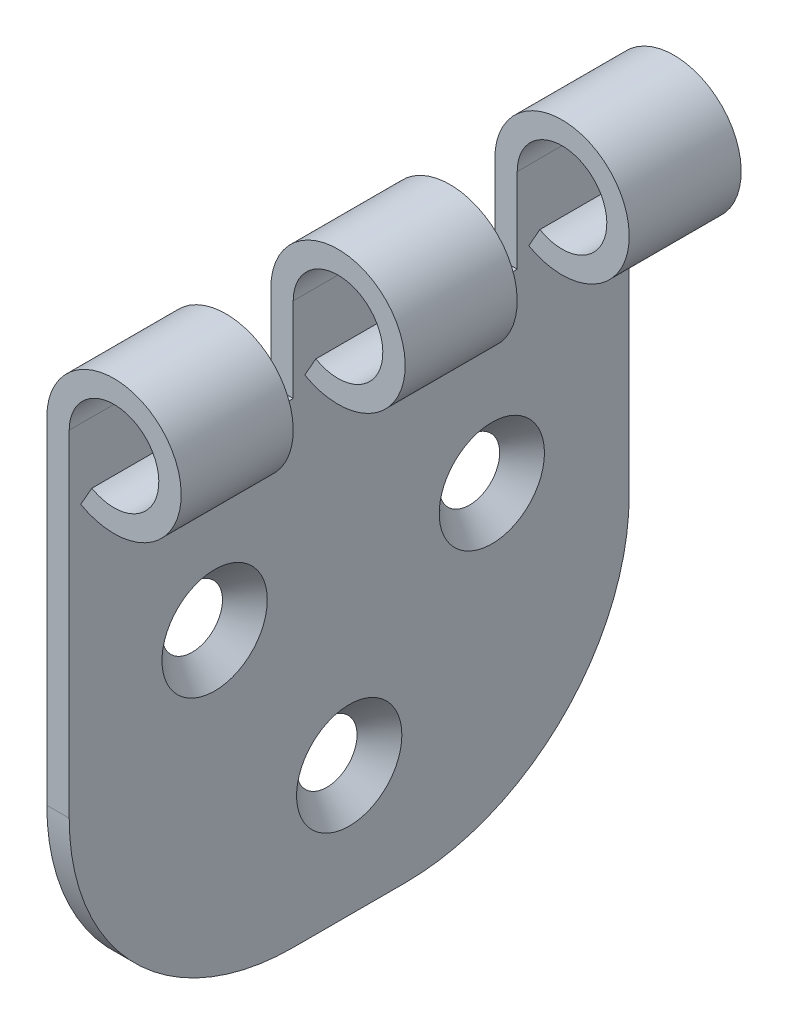
ISO-10303-21;
HEADER;
FILE_DESCRIPTION(('STEP AP214'),'2;1');
FILE_NAME('part.step','',(''),(''),'','','');
FILE_SCHEMA(('AUTOMOTIVE_DESIGN { 1 0 10303 214 1 1 1 1 }'));
ENDSEC;
DATA;
#1=APPLICATION_CONTEXT('core data for automotive mechanical design processes');
#2=APPLICATION_PROTOCOL_DEFINITION('international standard','automotive_design',2000,#1);
#3=PRODUCT_CONTEXT('',#1,'mechanical');
#4=PRODUCT('Part','Part','',(#3));
#5=PRODUCT_RELATED_PRODUCT_CATEGORY('part','',(#4));
#6=PRODUCT_DEFINITION_FORMATION('','',#4);
#7=PRODUCT_DEFINITION_CONTEXT('part definition',#1,'design');
#8=PRODUCT_DEFINITION('design','',#6,#7);
#9=PRODUCT_DEFINITION_SHAPE('','',#8);
#10=(LENGTH_UNIT() NAMED_UNIT(*) SI_UNIT(.MILLI.,.METRE.));
#11=(NAMED_UNIT(*) PLANE_ANGLE_UNIT() SI_UNIT($,.RADIAN.));
#12=(NAMED_UNIT(*) SI_UNIT($,.STERADIAN.) SOLID_ANGLE_UNIT());
#13=UNCERTAINTY_MEASURE_WITH_UNIT(LENGTH_MEASURE(1.E-05),#10,'distance_accuracy_value','');
#14=(GEOMETRIC_REPRESENTATION_CONTEXT(3) GLOBAL_UNCERTAINTY_ASSIGNED_CONTEXT((#13)) GLOBAL_UNIT_ASSIGNED_CONTEXT((#10,
#11,#12)) REPRESENTATION_CONTEXT('',''));
#15=CARTESIAN_POINT('',(0.,0.,0.));
#16=DIRECTION('',(0.,0.,1.));
#17=DIRECTION('',(1.,0.,0.));
#18=AXIS2_PLACEMENT_3D('',#15,#16,#17);
#19=CARTESIAN_POINT('',(1.99999999999999,50.,25.));
#20=DIRECTION('',(-1.,0.,0.));
#21=DIRECTION('',(0.,-1.,0.));
#22=AXIS2_PLACEMENT_3D('',#19,#20,#21);
#23=PLANE('',#22);
#24=CARTESIAN_POINT('',(2.,28.0397626935268,12.0173285585912));
#25=DIRECTION('',(1.,0.,0.));
#26=DIRECTION('',(0.,0.,-1.));
#27=AXIS2_PLACEMENT_3D('',#24,#25,#26);
#28=CIRCLE('',#27,4.7);
#29=CARTESIAN_POINT('',(2.,28.0397626935268,7.3173285585912));
#30=VERTEX_POINT('',#29);
#31=EDGE_CURVE('E238',#30,#30,#28,.T.);
#32=ORIENTED_EDGE('',*,*,#31,.F.);
#33=EDGE_LOOP('',(#32));
#34=FACE_BOUND('',#33,.T.);
#35=CARTESIAN_POINT('',(2.,27.0383186469775,-12.7326457346978));
#36=DIRECTION('',(1.,0.,0.));
#37=DIRECTION('',(0.,0.,-1.));
#38=AXIS2_PLACEMENT_3D('',#35,#36,#37);
#39=CIRCLE('',#38,4.7);
#40=CARTESIAN_POINT('',(2.,27.0383186469775,-17.4326457346978));
#41=VERTEX_POINT('',#40);
#42=EDGE_CURVE('E227',#41,#41,#39,.T.);
#43=ORIENTED_EDGE('',*,*,#42,.F.);
#44=EDGE_LOOP('',(#43));
#45=FACE_BOUND('',#44,.T.);
#46=DIRECTION('',(0.,0.,-1.));
#47=VECTOR('',#46,1.);
#48=CARTESIAN_POINT('',(2.,0.,25.));
#49=LINE('',#48,#47);
#50=CARTESIAN_POINT('',(2.,0.,5.));
#51=VERTEX_POINT('',#50);
#52=CARTESIAN_POINT('',(2.,0.,-5.));
#53=VERTEX_POINT('',#52);
#54=EDGE_CURVE('E212',#51,#53,#49,.T.);
#55=ORIENTED_EDGE('',*,*,#54,.T.);
#56=CARTESIAN_POINT('',(2.,20.,-5.));
#57=DIRECTION('',(-1.,0.,0.));
#58=DIRECTION('',(0.,-1.,0.));
#59=AXIS2_PLACEMENT_3D('',#56,#57,#58);
#60=CIRCLE('',#59,20.);
#61=CARTESIAN_POINT('',(2.,20.,-25.));
#62=VERTEX_POINT('',#61);
#63=EDGE_CURVE('E220',#53,#62,#60,.F.);
#64=ORIENTED_EDGE('',*,*,#63,.T.);
#65=DIRECTION('',(0.,1.,0.));
#66=VECTOR('',#65,1.);
#67=CARTESIAN_POINT('',(1.99999999999999,50.,-25.));
#68=LINE('',#67,#66);
#69=CARTESIAN_POINT('',(1.99999999999999,50.,-25.));
#70=VERTEX_POINT('',#69);
#71=EDGE_CURVE('E283',#62,#70,#68,.T.);
#72=ORIENTED_EDGE('',*,*,#71,.T.);
#73=DIRECTION('',(0.,0.,-1.));
#74=VECTOR('',#73,1.);
#75=CARTESIAN_POINT('',(1.99999999999999,50.,25.));
#76=LINE('',#75,#74);
#77=CARTESIAN_POINT('',(1.99999999999999,50.,-15.));
#78=VERTEX_POINT('',#77);
#79=EDGE_CURVE('E321',#78,#70,#76,.T.);
#80=ORIENTED_EDGE('',*,*,#79,.F.);
#81=DIRECTION('',(0.,1.,0.));
#82=VECTOR('',#81,1.);
#83=CARTESIAN_POINT('',(1.99999999999999,50.,-15.));
#84=LINE('',#83,#82);
#85=CARTESIAN_POINT('',(1.99999999999999,42.4546694492504,-15.));
#86=VERTEX_POINT('',#85);
#87=EDGE_CURVE('E254',#86,#78,#84,.T.);
#88=ORIENTED_EDGE('',*,*,#87,.F.);
#89=DIRECTION('',(0.,0.,-1.));
#90=VECTOR('',#89,1.);
#91=CARTESIAN_POINT('',(1.99999999999999,42.4546694492504,25.));
#92=LINE('',#91,#90);
#93=CARTESIAN_POINT('',(1.99999999999999,42.4546694492504,-5.));
#94=VERTEX_POINT('',#93);
#95=EDGE_CURVE('E256',#94,#86,#92,.T.);
#96=ORIENTED_EDGE('',*,*,#95,.F.);
#97=DIRECTION('',(0.,-1.,0.));
#98=VECTOR('',#97,1.);
#99=CARTESIAN_POINT('',(1.99999999999999,50.,-5.));
#100=LINE('',#99,#98);
#101=CARTESIAN_POINT('',(1.99999999999999,50.,-5.));
#102=VERTEX_POINT('',#101);
#103=EDGE_CURVE('E264',#102,#94,#100,.T.);
#104=ORIENTED_EDGE('',*,*,#103,.F.);
#105=CARTESIAN_POINT('',(1.99999999999999,50.,5.));
#106=VERTEX_POINT('',#105);
#107=EDGE_CURVE('E325',#106,#102,#76,.T.);
#108=ORIENTED_EDGE('',*,*,#107,.F.);
#109=DIRECTION('',(0.,1.,0.));
#110=VECTOR('',#109,1.);
#111=CARTESIAN_POINT('',(1.99999999999999,50.,5.));
#112=LINE('',#111,#110);
#113=CARTESIAN_POINT('',(1.99999999999999,42.4546694492504,5.));
#114=VERTEX_POINT('',#113);
#115=EDGE_CURVE('E272',#114,#106,#112,.T.);
#116=ORIENTED_EDGE('',*,*,#115,.F.);
#117=DIRECTION('',(0.,0.,-1.));
#118=VECTOR('',#117,1.);
#119=CARTESIAN_POINT('',(1.99999999999999,42.4546694492504,25.));
#120=LINE('',#119,#118);
#121=CARTESIAN_POINT('',(1.99999999999999,42.4546694492504,15.));
#122=VERTEX_POINT('',#121);
#123=EDGE_CURVE('E274',#122,#114,#120,.T.);
#124=ORIENTED_EDGE('',*,*,#123,.F.);
#125=DIRECTION('',(0.,-1.,0.));
#126=VECTOR('',#125,1.);
#127=CARTESIAN_POINT('',(1.99999999999999,50.,15.));
#128=LINE('',#127,#126);
#129=CARTESIAN_POINT('',(1.99999999999999,50.,15.));
#130=VERTEX_POINT('',#129);
#131=EDGE_CURVE('E188',#130,#122,#128,.T.);
#132=ORIENTED_EDGE('',*,*,#131,.F.);
#133=CARTESIAN_POINT('',(1.99999999999999,50.,25.));
#134=VERTEX_POINT('',#133);
#135=EDGE_CURVE('E323',#134,#130,#76,.T.);
#136=ORIENTED_EDGE('',*,*,#135,.F.);
#137=DIRECTION('',(0.,1.,0.));
#138=VECTOR('',#137,1.);
#139=CARTESIAN_POINT('',(1.99999999999999,50.,25.));
#140=LINE('',#139,#138);
#141=CARTESIAN_POINT('',(2.,20.,25.));
#142=VERTEX_POINT('',#141);
#143=EDGE_CURVE('E284',#142,#134,#140,.T.);
#144=ORIENTED_EDGE('',*,*,#143,.F.);
#145=CARTESIAN_POINT('',(2.,20.,5.));
#146=DIRECTION('',(-1.,0.,0.));
#147=DIRECTION('',(0.,-1.,0.));
#148=AXIS2_PLACEMENT_3D('',#145,#146,#147);
#149=CIRCLE('',#148,20.);
#150=EDGE_CURVE('E218',#142,#51,#149,.F.);
#151=ORIENTED_EDGE('',*,*,#150,.T.);
#152=EDGE_LOOP('',(#55,#64,#72,#80,#88,#96,#104,#108,#116,#124,#132,#136,#144,#151));
#153=FACE_BOUND('',#152,.T.);
#154=CARTESIAN_POINT('',(2.,11.5874676430746,0.));
#155=DIRECTION('',(1.,0.,0.));
#156=DIRECTION('',(0.,0.,-1.));
#157=AXIS2_PLACEMENT_3D('',#154,#155,#156);
#158=CIRCLE('',#157,4.7);
#159=CARTESIAN_POINT('',(2.,11.5874676430746,-4.7));
#160=VERTEX_POINT('',#159);
#161=EDGE_CURVE('E612',#160,#160,#158,.T.);
#162=ORIENTED_EDGE('',*,*,#161,.F.);
#163=EDGE_LOOP('',(#162));
#164=FACE_BOUND('',#163,.T.);
#165=ADVANCED_FACE('F38',(#34,#45,#153,#164),#23,.F.);
#166=CARTESIAN_POINT('',(0.,0.,25.));
#167=DIRECTION('',(1.,0.,0.));
#168=DIRECTION('',(0.,0.,-1.));
#169=AXIS2_PLACEMENT_3D('',#166,#167,#168);
#170=PLANE('',#169);
#171=CARTESIAN_POINT('',(0.,11.5874676430746,0.));
#172=DIRECTION('',(1.,0.,0.));
#173=DIRECTION('',(0.,0.,-1.));
#174=AXIS2_PLACEMENT_3D('',#171,#172,#173);
#175=CIRCLE('',#174,2.7);
#176=CARTESIAN_POINT('',(0.,11.5874676430746,-2.7));
#177=VERTEX_POINT('',#176);
#178=EDGE_CURVE('E615',#177,#177,#175,.T.);
#179=ORIENTED_EDGE('',*,*,#178,.T.);
#180=EDGE_LOOP('',(#179));
#181=FACE_BOUND('',#180,.T.);
#182=CARTESIAN_POINT('',(0.,28.0397626935268,12.0173285585912));
#183=DIRECTION('',(1.,0.,0.));
#184=DIRECTION('',(0.,0.,-1.));
#185=AXIS2_PLACEMENT_3D('',#182,#183,#184);
#186=CIRCLE('',#185,2.7);
#187=CARTESIAN_POINT('',(0.,28.0397626935268,9.3173285585912));
#188=VERTEX_POINT('',#187);
#189=EDGE_CURVE('E42',#188,#188,#186,.T.);
#190=ORIENTED_EDGE('',*,*,#189,.T.);
#191=EDGE_LOOP('',(#190));
#192=FACE_BOUND('',#191,.T.);
#193=CARTESIAN_POINT('',(0.,27.0383186469775,-12.7326457346978));
#194=DIRECTION('',(1.,0.,0.));
#195=DIRECTION('',(0.,0.,-1.));
#196=AXIS2_PLACEMENT_3D('',#193,#194,#195);
#197=CIRCLE('',#196,2.7);
#198=CARTESIAN_POINT('',(0.,27.0383186469775,-15.4326457346978));
#199=VERTEX_POINT('',#198);
#200=EDGE_CURVE('E224',#199,#199,#197,.T.);
#201=ORIENTED_EDGE('',*,*,#200,.T.);
#202=EDGE_LOOP('',(#201));
#203=FACE_BOUND('',#202,.T.);
#204=DIRECTION('',(0.,-1.,0.));
#205=VECTOR('',#204,1.);
#206=CARTESIAN_POINT('',(0.,0.,-25.));
#207=LINE('',#206,#205);
#208=CARTESIAN_POINT('',(0.,50.,-25.));
#209=VERTEX_POINT('',#208);
#210=CARTESIAN_POINT('',(0.,20.,-25.));
#211=VERTEX_POINT('',#210);
#212=EDGE_CURVE('E287',#209,#211,#207,.T.);
#213=ORIENTED_EDGE('',*,*,#212,.T.);
#214=CARTESIAN_POINT('',(0.,20.,-5.));
#215=DIRECTION('',(1.,0.,0.));
#216=DIRECTION('',(0.,0.,-1.));
#217=AXIS2_PLACEMENT_3D('',#214,#215,#216);
#218=CIRCLE('',#217,20.);
#219=CARTESIAN_POINT('',(0.,0.,-5.));
#220=VERTEX_POINT('',#219);
#221=EDGE_CURVE('E47',#211,#220,#218,.F.);
#222=ORIENTED_EDGE('',*,*,#221,.T.);
#223=DIRECTION('',(0.,0.,-1.));
#224=VECTOR('',#223,1.);
#225=CARTESIAN_POINT('',(0.,0.,25.));
#226=LINE('',#225,#224);
#227=CARTESIAN_POINT('',(0.,0.,5.));
#228=VERTEX_POINT('',#227);
#229=EDGE_CURVE('E295',#228,#220,#226,.T.);
#230=ORIENTED_EDGE('',*,*,#229,.F.);
#231=CARTESIAN_POINT('',(0.,20.,5.));
#232=DIRECTION('',(1.,0.,0.));
#233=DIRECTION('',(0.,0.,-1.));
#234=AXIS2_PLACEMENT_3D('',#231,#232,#233);
#235=CIRCLE('',#234,20.);
#236=CARTESIAN_POINT('',(0.,20.,25.));
#237=VERTEX_POINT('',#236);
#238=EDGE_CURVE('E55',#228,#237,#235,.F.);
#239=ORIENTED_EDGE('',*,*,#238,.T.);
#240=DIRECTION('',(0.,-1.,0.));
#241=VECTOR('',#240,1.);
#242=CARTESIAN_POINT('',(0.,0.,25.));
#243=LINE('',#242,#241);
#244=CARTESIAN_POINT('',(0.,50.,25.));
#245=VERTEX_POINT('',#244);
#246=EDGE_CURVE('E293',#245,#237,#243,.T.);
#247=ORIENTED_EDGE('',*,*,#246,.F.);
#248=DIRECTION('',(0.,0.,-1.));
#249=VECTOR('',#248,1.);
#250=CARTESIAN_POINT('',(0.,50.,25.));
#251=LINE('',#250,#249);
#252=CARTESIAN_POINT('',(0.,50.,15.));
#253=VERTEX_POINT('',#252);
#254=EDGE_CURVE('E205',#245,#253,#251,.T.);
#255=ORIENTED_EDGE('',*,*,#254,.T.);
#256=DIRECTION('',(0.,1.,0.));
#257=VECTOR('',#256,1.);
#258=CARTESIAN_POINT('',(0.,0.,15.));
#259=LINE('',#258,#257);
#260=CARTESIAN_POINT('',(0.,42.4546694492504,15.));
#261=VERTEX_POINT('',#260);
#262=EDGE_CURVE('E185',#261,#253,#259,.T.);
#263=ORIENTED_EDGE('',*,*,#262,.F.);
#264=DIRECTION('',(0.,0.,-1.));
#265=VECTOR('',#264,1.);
#266=CARTESIAN_POINT('',(0.,42.4546694492504,15.));
#267=LINE('',#266,#265);
#268=CARTESIAN_POINT('',(0.,42.4546694492504,5.));
#269=VERTEX_POINT('',#268);
#270=EDGE_CURVE('E195',#261,#269,#267,.T.);
#271=ORIENTED_EDGE('',*,*,#270,.T.);
#272=DIRECTION('',(0.,1.,0.));
#273=VECTOR('',#272,1.);
#274=CARTESIAN_POINT('',(0.,63.0450910057158,5.));
#275=LINE('',#274,#273);
#276=CARTESIAN_POINT('',(0.,50.,5.));
#277=VERTEX_POINT('',#276);
#278=EDGE_CURVE('E200',#269,#277,#275,.T.);
#279=ORIENTED_EDGE('',*,*,#278,.T.);
#280=CARTESIAN_POINT('',(0.,50.,-5.));
#281=VERTEX_POINT('',#280);
#282=EDGE_CURVE('E312',#277,#281,#251,.T.);
#283=ORIENTED_EDGE('',*,*,#282,.T.);
#284=DIRECTION('',(0.,1.,0.));
#285=VECTOR('',#284,1.);
#286=CARTESIAN_POINT('',(0.,0.,-5.));
#287=LINE('',#286,#285);
#288=CARTESIAN_POINT('',(0.,42.4546694492504,-5.));
#289=VERTEX_POINT('',#288);
#290=EDGE_CURVE('E207',#289,#281,#287,.T.);
#291=ORIENTED_EDGE('',*,*,#290,.F.);
#292=DIRECTION('',(0.,0.,-1.));
#293=VECTOR('',#292,1.);
#294=CARTESIAN_POINT('',(0.,42.4546694492504,-5.));
#295=LINE('',#294,#293);
#296=CARTESIAN_POINT('',(0.,42.4546694492504,-15.));
#297=VERTEX_POINT('',#296);
#298=EDGE_CURVE('E226',#289,#297,#295,.T.);
#299=ORIENTED_EDGE('',*,*,#298,.T.);
#300=DIRECTION('',(0.,1.,0.));
#301=VECTOR('',#300,1.);
#302=CARTESIAN_POINT('',(0.,63.0450910057158,-15.));
#303=LINE('',#302,#301);
#304=CARTESIAN_POINT('',(0.,50.,-15.));
#305=VERTEX_POINT('',#304);
#306=EDGE_CURVE('E231',#297,#305,#303,.T.);
#307=ORIENTED_EDGE('',*,*,#306,.T.);
#308=EDGE_CURVE('E309',#305,#209,#251,.T.);
#309=ORIENTED_EDGE('',*,*,#308,.T.);
#310=EDGE_LOOP('',(#213,#222,#230,#239,#247,#255,#263,#271,#279,#283,#291,#299,#307,#309));
#311=FACE_BOUND('',#310,.T.);
#312=ADVANCED_FACE('F203',(#181,#192,#203,#311),#170,.F.);
#313=CARTESIAN_POINT('',(6.,50.,25.));
#314=DIRECTION('',(0.,0.,-1.));
#315=DIRECTION('',(-1.,0.,0.));
#316=AXIS2_PLACEMENT_3D('',#313,#314,#315);
#317=CYLINDRICAL_SURFACE('',#316,4.00000000000001);
#318=CARTESIAN_POINT('',(6.,50.,15.));
#319=DIRECTION('',(0.,0.,-1.));
#320=DIRECTION('',(-1.,0.,0.));
#321=AXIS2_PLACEMENT_3D('',#318,#319,#320);
#322=CIRCLE('',#321,4.00000000000001);
#323=CARTESIAN_POINT('',(4.02184665664863,46.5233767316277,15.));
#324=VERTEX_POINT('',#323);
#325=EDGE_CURVE('E280',#324,#130,#322,.F.);
#326=ORIENTED_EDGE('',*,*,#325,.F.);
#327=DIRECTION('',(0.,0.,-1.));
#328=VECTOR('',#327,1.);
#329=CARTESIAN_POINT('',(4.02184665664862,46.5233767316277,25.));
#330=LINE('',#329,#328);
#331=CARTESIAN_POINT('',(4.02184665664862,46.5233767316277,25.));
#332=VERTEX_POINT('',#331);
#333=EDGE_CURVE('E318',#332,#324,#330,.T.);
#334=ORIENTED_EDGE('',*,*,#333,.F.);
#335=CARTESIAN_POINT('',(6.,50.,25.));
#336=DIRECTION('',(0.,0.,-1.));
#337=DIRECTION('',(1.,0.,0.));
#338=AXIS2_PLACEMENT_3D('',#335,#336,#337);
#339=CIRCLE('',#338,4.00000000000001);
#340=EDGE_CURVE('E286',#134,#332,#339,.T.);
#341=ORIENTED_EDGE('',*,*,#340,.F.);
#342=ORIENTED_EDGE('',*,*,#135,.T.);
#343=EDGE_LOOP('',(#326,#334,#341,#342));
#344=FACE_BOUND('',#343,.T.);
#345=ADVANCED_FACE('F344',(#344),#317,.F.);
#346=CARTESIAN_POINT('',(6.,50.,5.));
#347=DIRECTION('',(0.,0.,1.));
#348=DIRECTION('',(1.,0.,0.));
#349=AXIS2_PLACEMENT_3D('',#346,#347,#348);
#350=CIRCLE('',#349,4.00000000000001);
#351=CARTESIAN_POINT('',(4.02184665664863,46.5233767316277,5.));
#352=VERTEX_POINT('',#351);
#353=EDGE_CURVE('E270',#106,#352,#350,.F.);
#354=ORIENTED_EDGE('',*,*,#353,.F.);
#355=ORIENTED_EDGE('',*,*,#107,.T.);
#356=CARTESIAN_POINT('',(6.,50.,-5.));
#357=DIRECTION('',(0.,0.,-1.));
#358=DIRECTION('',(-1.,0.,0.));
#359=AXIS2_PLACEMENT_3D('',#356,#357,#358);
#360=CIRCLE('',#359,4.00000000000001);
#361=CARTESIAN_POINT('',(4.02184665664863,46.5233767316277,-5.));
#362=VERTEX_POINT('',#361);
#363=EDGE_CURVE('E262',#362,#102,#360,.F.);
#364=ORIENTED_EDGE('',*,*,#363,.F.);
#365=EDGE_CURVE('E322',#352,#362,#330,.T.);
#366=ORIENTED_EDGE('',*,*,#365,.F.);
#367=EDGE_LOOP('',(#354,#355,#364,#366));
#368=FACE_BOUND('',#367,.T.);
#369=ADVANCED_FACE('F414',(#368),#317,.F.);
#370=CARTESIAN_POINT('',(6.,50.,-15.));
#371=DIRECTION('',(0.,0.,1.));
#372=DIRECTION('',(1.,0.,0.));
#373=AXIS2_PLACEMENT_3D('',#370,#371,#372);
#374=CIRCLE('',#373,4.00000000000001);
#375=CARTESIAN_POINT('',(4.02184665664863,46.5233767316277,-15.));
#376=VERTEX_POINT('',#375);
#377=EDGE_CURVE('E252',#78,#376,#374,.F.);
#378=ORIENTED_EDGE('',*,*,#377,.F.);
#379=ORIENTED_EDGE('',*,*,#79,.T.);
#380=CARTESIAN_POINT('',(6.,50.,-25.));
#381=DIRECTION('',(0.,0.,-1.));
#382=DIRECTION('',(1.,0.,0.));
#383=AXIS2_PLACEMENT_3D('',#380,#381,#382);
#384=CIRCLE('',#383,4.00000000000001);
#385=CARTESIAN_POINT('',(4.02184665664862,46.5233767316277,-25.));
#386=VERTEX_POINT('',#385);
#387=EDGE_CURVE('E297',#70,#386,#384,.T.);
#388=ORIENTED_EDGE('',*,*,#387,.T.);
#389=EDGE_CURVE('E316',#376,#386,#330,.T.);
#390=ORIENTED_EDGE('',*,*,#389,.F.);
#391=EDGE_LOOP('',(#378,#379,#388,#390));
#392=FACE_BOUND('',#391,.T.);
#393=ADVANCED_FACE('F405',(#392),#317,.F.);
#394=CARTESIAN_POINT('',(3.03276998497294,44.7850650974415,25.));
#395=DIRECTION('',(0.869155817093078,-0.494538335837844,0.));
#396=DIRECTION('',(0.494538335837844,0.869155817093078,0.));
#397=AXIS2_PLACEMENT_3D('',#394,#395,#396);
#398=PLANE('',#397);
#399=DIRECTION('',(0.494538335837844,0.869155817093078,0.));
#400=VECTOR('',#399,1.);
#401=CARTESIAN_POINT('',(3.03276998497294,44.7850650974415,15.));
#402=LINE('',#401,#400);
#403=CARTESIAN_POINT('',(3.03276998497294,44.7850650974415,15.));
#404=VERTEX_POINT('',#403);
#405=EDGE_CURVE('E278',#404,#324,#402,.T.);
#406=ORIENTED_EDGE('',*,*,#405,.F.);
#407=DIRECTION('',(0.,0.,-1.));
#408=VECTOR('',#407,1.);
#409=CARTESIAN_POINT('',(3.03276998497294,44.7850650974415,25.));
#410=LINE('',#409,#408);
#411=CARTESIAN_POINT('',(3.03276998497294,44.7850650974415,25.));
#412=VERTEX_POINT('',#411);
#413=EDGE_CURVE('E313',#412,#404,#410,.T.);
#414=ORIENTED_EDGE('',*,*,#413,.F.);
#415=DIRECTION('',(-0.494538335837844,-0.869155817093078,0.));
#416=VECTOR('',#415,1.);
#417=CARTESIAN_POINT('',(3.03276998497294,44.7850650974415,25.));
#418=LINE('',#417,#416);
#419=EDGE_CURVE('E289',#332,#412,#418,.T.);
#420=ORIENTED_EDGE('',*,*,#419,.F.);
#421=ORIENTED_EDGE('',*,*,#333,.T.);
#422=EDGE_LOOP('',(#406,#414,#420,#421));
#423=FACE_BOUND('',#422,.T.);
#424=ADVANCED_FACE('F350',(#423),#398,.F.);
#425=DIRECTION('',(-0.494538335837844,-0.869155817093078,0.));
#426=VECTOR('',#425,1.);
#427=CARTESIAN_POINT('',(3.03276998497294,44.7850650974415,5.));
#428=LINE('',#427,#426);
#429=CARTESIAN_POINT('',(3.03276998497294,44.7850650974415,5.));
#430=VERTEX_POINT('',#429);
#431=EDGE_CURVE('E268',#352,#430,#428,.T.);
#432=ORIENTED_EDGE('',*,*,#431,.F.);
#433=ORIENTED_EDGE('',*,*,#365,.T.);
#434=DIRECTION('',(0.494538335837844,0.869155817093078,0.));
#435=VECTOR('',#434,1.);
#436=CARTESIAN_POINT('',(3.03276998497294,44.7850650974415,-5.));
#437=LINE('',#436,#435);
#438=CARTESIAN_POINT('',(3.03276998497294,44.7850650974415,-5.));
#439=VERTEX_POINT('',#438);
#440=EDGE_CURVE('E260',#439,#362,#437,.T.);
#441=ORIENTED_EDGE('',*,*,#440,.F.);
#442=EDGE_CURVE('E317',#430,#439,#410,.T.);
#443=ORIENTED_EDGE('',*,*,#442,.F.);
#444=EDGE_LOOP('',(#432,#433,#441,#443));
#445=FACE_BOUND('',#444,.T.);
#446=ADVANCED_FACE('F363',(#445),#398,.F.);
#447=DIRECTION('',(-0.494538335837844,-0.869155817093078,0.));
#448=VECTOR('',#447,1.);
#449=CARTESIAN_POINT('',(3.03276998497294,44.7850650974415,-15.));
#450=LINE('',#449,#448);
#451=CARTESIAN_POINT('',(3.03276998497294,44.7850650974415,-15.));
#452=VERTEX_POINT('',#451);
#453=EDGE_CURVE('E250',#376,#452,#450,.T.);
#454=ORIENTED_EDGE('',*,*,#453,.F.);
#455=ORIENTED_EDGE('',*,*,#389,.T.);
#456=DIRECTION('',(-0.494538335837844,-0.869155817093078,0.));
#457=VECTOR('',#456,1.);
#458=CARTESIAN_POINT('',(3.03276998497294,44.7850650974415,-25.));
#459=LINE('',#458,#457);
#460=CARTESIAN_POINT('',(3.03276998497294,44.7850650974415,-25.));
#461=VERTEX_POINT('',#460);
#462=EDGE_CURVE('E300',#386,#461,#459,.T.);
#463=ORIENTED_EDGE('',*,*,#462,.T.);
#464=EDGE_CURVE('E311',#452,#461,#410,.T.);
#465=ORIENTED_EDGE('',*,*,#464,.F.);
#466=EDGE_LOOP('',(#454,#455,#463,#465));
#467=FACE_BOUND('',#466,.T.);
#468=ADVANCED_FACE('F355',(#467),#398,.F.);
#469=CARTESIAN_POINT('',(6.,50.,25.));
#470=DIRECTION('',(0.,0.,-1.));
#471=DIRECTION('',(-1.,0.,0.));
#472=AXIS2_PLACEMENT_3D('',#469,#470,#471);
#473=CYLINDRICAL_SURFACE('',#472,6.);
#474=CARTESIAN_POINT('',(6.,50.,15.));
#475=DIRECTION('',(0.,0.,-1.));
#476=DIRECTION('',(-1.,0.,0.));
#477=AXIS2_PLACEMENT_3D('',#474,#475,#476);
#478=CIRCLE('',#477,6.);
#479=EDGE_CURVE('E276',#253,#404,#478,.T.);
#480=ORIENTED_EDGE('',*,*,#479,.F.);
#481=ORIENTED_EDGE('',*,*,#254,.F.);
#482=CARTESIAN_POINT('',(6.,50.,25.));
#483=DIRECTION('',(0.,0.,1.));
#484=DIRECTION('',(1.,0.,0.));
#485=AXIS2_PLACEMENT_3D('',#482,#483,#484);
#486=CIRCLE('',#485,6.);
#487=EDGE_CURVE('E291',#412,#245,#486,.T.);
#488=ORIENTED_EDGE('',*,*,#487,.F.);
#489=ORIENTED_EDGE('',*,*,#413,.T.);
#490=EDGE_LOOP('',(#480,#481,#488,#489));
#491=FACE_BOUND('',#490,.T.);
#492=ADVANCED_FACE('F352',(#491),#473,.T.);
#493=ORIENTED_EDGE('',*,*,#282,.F.);
#494=CARTESIAN_POINT('',(6.,50.,5.));
#495=DIRECTION('',(0.,0.,1.));
#496=DIRECTION('',(1.,0.,0.));
#497=AXIS2_PLACEMENT_3D('',#494,#495,#496);
#498=CIRCLE('',#497,6.);
#499=EDGE_CURVE('E266',#430,#277,#498,.T.);
#500=ORIENTED_EDGE('',*,*,#499,.F.);
#501=ORIENTED_EDGE('',*,*,#442,.T.);
#502=CARTESIAN_POINT('',(6.,50.,-5.));
#503=DIRECTION('',(0.,0.,-1.));
#504=DIRECTION('',(-1.,0.,0.));
#505=AXIS2_PLACEMENT_3D('',#502,#503,#504);
#506=CIRCLE('',#505,6.);
#507=EDGE_CURVE('E258',#281,#439,#506,.T.);
#508=ORIENTED_EDGE('',*,*,#507,.F.);
#509=EDGE_LOOP('',(#493,#500,#501,#508));
#510=FACE_BOUND('',#509,.T.);
#511=ADVANCED_FACE('F354',(#510),#473,.T.);
#512=ORIENTED_EDGE('',*,*,#308,.F.);
#513=CARTESIAN_POINT('',(6.,50.,-15.));
#514=DIRECTION('',(0.,0.,1.));
#515=DIRECTION('',(1.,0.,0.));
#516=AXIS2_PLACEMENT_3D('',#513,#514,#515);
#517=CIRCLE('',#516,6.);
#518=EDGE_CURVE('E191',#452,#305,#517,.T.);
#519=ORIENTED_EDGE('',*,*,#518,.F.);
#520=ORIENTED_EDGE('',*,*,#464,.T.);
#521=CARTESIAN_POINT('',(6.,50.,-25.));
#522=DIRECTION('',(0.,0.,1.));
#523=DIRECTION('',(1.,0.,0.));
#524=AXIS2_PLACEMENT_3D('',#521,#522,#523);
#525=CIRCLE('',#524,6.);
#526=EDGE_CURVE('E303',#461,#209,#525,.T.);
#527=ORIENTED_EDGE('',*,*,#526,.T.);
#528=EDGE_LOOP('',(#512,#519,#520,#527));
#529=FACE_BOUND('',#528,.T.);
#530=ADVANCED_FACE('F357',(#529),#473,.T.);
#531=CARTESIAN_POINT('',(2.,0.,25.));
#532=DIRECTION('',(0.,1.,0.));
#533=DIRECTION('',(-1.,0.,0.));
#534=AXIS2_PLACEMENT_3D('',#531,#532,#533);
#535=PLANE('',#534);
#536=ORIENTED_EDGE('',*,*,#229,.T.);
#537=DIRECTION('',(1.,0.,0.));
#538=VECTOR('',#537,1.);
#539=CARTESIAN_POINT('',(2.,0.,-5.));
#540=LINE('',#539,#538);
#541=EDGE_CURVE('E209',#220,#53,#540,.T.);
#542=ORIENTED_EDGE('',*,*,#541,.T.);
#543=ORIENTED_EDGE('',*,*,#54,.F.);
#544=DIRECTION('',(1.,0.,0.));
#545=VECTOR('',#544,1.);
#546=CARTESIAN_POINT('',(0.,0.,5.));
#547=LINE('',#546,#545);
#548=EDGE_CURVE('E206',#51,#228,#547,.F.);
#549=ORIENTED_EDGE('',*,*,#548,.T.);
#550=EDGE_LOOP('',(#536,#542,#543,#549));
#551=FACE_BOUND('',#550,.T.);
#552=ADVANCED_FACE('F333',(#551),#535,.F.);
#553=CARTESIAN_POINT('',(6.,50.,25.));
#554=DIRECTION('',(0.,0.,1.));
#555=DIRECTION('',(1.,0.,0.));
#556=AXIS2_PLACEMENT_3D('',#553,#554,#555);
#557=PLANE('',#556);
#558=ORIENTED_EDGE('',*,*,#246,.T.);
#559=DIRECTION('',(1.,0.,0.));
#560=VECTOR('',#559,1.);
#561=CARTESIAN_POINT('',(2.,20.,25.));
#562=LINE('',#561,#560);
#563=EDGE_CURVE('E11',#237,#142,#562,.T.);
#564=ORIENTED_EDGE('',*,*,#563,.T.);
#565=ORIENTED_EDGE('',*,*,#143,.T.);
#566=ORIENTED_EDGE('',*,*,#340,.T.);
#567=ORIENTED_EDGE('',*,*,#419,.T.);
#568=ORIENTED_EDGE('',*,*,#487,.T.);
#569=EDGE_LOOP('',(#558,#564,#565,#566,#567,#568));
#570=FACE_BOUND('',#569,.T.);
#571=ADVANCED_FACE('F338',(#570),#557,.T.);
#572=CARTESIAN_POINT('',(6.,50.,-25.));
#573=DIRECTION('',(0.,0.,1.));
#574=DIRECTION('',(1.,0.,0.));
#575=AXIS2_PLACEMENT_3D('',#572,#573,#574);
#576=PLANE('',#575);
#577=ORIENTED_EDGE('',*,*,#71,.F.);
#578=DIRECTION('',(1.,0.,0.));
#579=VECTOR('',#578,1.);
#580=CARTESIAN_POINT('',(6.,20.,-25.));
#581=LINE('',#580,#579);
#582=EDGE_CURVE('E63',#62,#211,#581,.F.);
#583=ORIENTED_EDGE('',*,*,#582,.T.);
#584=ORIENTED_EDGE('',*,*,#212,.F.);
#585=ORIENTED_EDGE('',*,*,#526,.F.);
#586=ORIENTED_EDGE('',*,*,#462,.F.);
#587=ORIENTED_EDGE('',*,*,#387,.F.);
#588=EDGE_LOOP('',(#577,#583,#584,#585,#586,#587));
#589=FACE_BOUND('',#588,.T.);
#590=ADVANCED_FACE('F395',(#589),#576,.F.);
#591=CARTESIAN_POINT('',(12.,63.0450910057158,-5.));
#592=DIRECTION('',(0.,0.,-1.));
#593=DIRECTION('',(-1.,0.,0.));
#594=AXIS2_PLACEMENT_3D('',#591,#592,#593);
#595=PLANE('',#594);
#596=ORIENTED_EDGE('',*,*,#103,.T.);
#597=DIRECTION('',(-1.,0.,0.));
#598=VECTOR('',#597,1.);
#599=CARTESIAN_POINT('',(12.,42.4546694492504,-5.));
#600=LINE('',#599,#598);
#601=EDGE_CURVE('E201',#94,#289,#600,.T.);
#602=ORIENTED_EDGE('',*,*,#601,.T.);
#603=ORIENTED_EDGE('',*,*,#290,.T.);
#604=ORIENTED_EDGE('',*,*,#507,.T.);
#605=ORIENTED_EDGE('',*,*,#440,.T.);
#606=ORIENTED_EDGE('',*,*,#363,.T.);
#607=EDGE_LOOP('',(#596,#602,#603,#604,#605,#606));
#608=FACE_BOUND('',#607,.T.);
#609=ADVANCED_FACE('F421',(#608),#595,.T.);
#610=CARTESIAN_POINT('',(12.,42.4546694492504,-5.));
#611=DIRECTION('',(0.,1.,0.));
#612=DIRECTION('',(-1.,0.,0.));
#613=AXIS2_PLACEMENT_3D('',#610,#611,#612);
#614=PLANE('',#613);
#615=ORIENTED_EDGE('',*,*,#95,.T.);
#616=DIRECTION('',(-1.,0.,0.));
#617=VECTOR('',#616,1.);
#618=CARTESIAN_POINT('',(12.,42.4546694492504,-15.));
#619=LINE('',#618,#617);
#620=EDGE_CURVE('E246',#86,#297,#619,.T.);
#621=ORIENTED_EDGE('',*,*,#620,.T.);
#622=ORIENTED_EDGE('',*,*,#298,.F.);
#623=ORIENTED_EDGE('',*,*,#601,.F.);
#624=EDGE_LOOP('',(#615,#621,#622,#623));
#625=FACE_BOUND('',#624,.T.);
#626=ADVANCED_FACE('F424',(#625),#614,.T.);
#627=CARTESIAN_POINT('',(12.,63.0450910057158,-15.));
#628=DIRECTION('',(0.,0.,1.));
#629=DIRECTION('',(1.,0.,0.));
#630=AXIS2_PLACEMENT_3D('',#627,#628,#629);
#631=PLANE('',#630);
#632=ORIENTED_EDGE('',*,*,#87,.T.);
#633=ORIENTED_EDGE('',*,*,#377,.T.);
#634=ORIENTED_EDGE('',*,*,#453,.T.);
#635=ORIENTED_EDGE('',*,*,#518,.T.);
#636=ORIENTED_EDGE('',*,*,#306,.F.);
#637=ORIENTED_EDGE('',*,*,#620,.F.);
#638=EDGE_LOOP('',(#632,#633,#634,#635,#636,#637));
#639=FACE_BOUND('',#638,.T.);
#640=ADVANCED_FACE('F508',(#639),#631,.T.);
#641=CARTESIAN_POINT('',(12.,63.0450910057158,15.));
#642=DIRECTION('',(0.,0.,-1.));
#643=DIRECTION('',(-1.,0.,0.));
#644=AXIS2_PLACEMENT_3D('',#641,#642,#643);
#645=PLANE('',#644);
#646=ORIENTED_EDGE('',*,*,#131,.T.);
#647=DIRECTION('',(-1.,0.,0.));
#648=VECTOR('',#647,1.);
#649=CARTESIAN_POINT('',(12.,42.4546694492504,15.));
#650=LINE('',#649,#648);
#651=EDGE_CURVE('E181',#122,#261,#650,.T.);
#652=ORIENTED_EDGE('',*,*,#651,.T.);
#653=ORIENTED_EDGE('',*,*,#262,.T.);
#654=ORIENTED_EDGE('',*,*,#479,.T.);
#655=ORIENTED_EDGE('',*,*,#405,.T.);
#656=ORIENTED_EDGE('',*,*,#325,.T.);
#657=EDGE_LOOP('',(#646,#652,#653,#654,#655,#656));
#658=FACE_BOUND('',#657,.T.);
#659=ADVANCED_FACE('F183',(#658),#645,.T.);
#660=CARTESIAN_POINT('',(12.,42.4546694492504,15.));
#661=DIRECTION('',(0.,1.,0.));
#662=DIRECTION('',(-1.,0.,0.));
#663=AXIS2_PLACEMENT_3D('',#660,#661,#662);
#664=PLANE('',#663);
#665=ORIENTED_EDGE('',*,*,#123,.T.);
#666=DIRECTION('',(-1.,0.,0.));
#667=VECTOR('',#666,1.);
#668=CARTESIAN_POINT('',(12.,42.4546694492504,5.));
#669=LINE('',#668,#667);
#670=EDGE_CURVE('E192',#114,#269,#669,.T.);
#671=ORIENTED_EDGE('',*,*,#670,.T.);
#672=ORIENTED_EDGE('',*,*,#270,.F.);
#673=ORIENTED_EDGE('',*,*,#651,.F.);
#674=EDGE_LOOP('',(#665,#671,#672,#673));
#675=FACE_BOUND('',#674,.T.);
#676=ADVANCED_FACE('F196',(#675),#664,.T.);
#677=CARTESIAN_POINT('',(12.,63.0450910057158,5.));
#678=DIRECTION('',(0.,0.,1.));
#679=DIRECTION('',(1.,0.,0.));
#680=AXIS2_PLACEMENT_3D('',#677,#678,#679);
#681=PLANE('',#680);
#682=ORIENTED_EDGE('',*,*,#115,.T.);
#683=ORIENTED_EDGE('',*,*,#353,.T.);
#684=ORIENTED_EDGE('',*,*,#431,.T.);
#685=ORIENTED_EDGE('',*,*,#499,.T.);
#686=ORIENTED_EDGE('',*,*,#278,.F.);
#687=ORIENTED_EDGE('',*,*,#670,.F.);
#688=EDGE_LOOP('',(#682,#683,#684,#685,#686,#687));
#689=FACE_BOUND('',#688,.T.);
#690=ADVANCED_FACE('F383',(#689),#681,.T.);
#691=CARTESIAN_POINT('',(2.,20.,-5.));
#692=DIRECTION('',(1.,0.,0.));
#693=DIRECTION('',(0.,1.,0.));
#694=AXIS2_PLACEMENT_3D('',#691,#692,#693);
#695=CYLINDRICAL_SURFACE('',#694,20.);
#696=ORIENTED_EDGE('',*,*,#221,.F.);
#697=ORIENTED_EDGE('',*,*,#582,.F.);
#698=ORIENTED_EDGE('',*,*,#63,.F.);
#699=ORIENTED_EDGE('',*,*,#541,.F.);
#700=EDGE_LOOP('',(#696,#697,#698,#699));
#701=FACE_BOUND('',#700,.T.);
#702=ADVANCED_FACE('F381',(#701),#695,.T.);
#703=CARTESIAN_POINT('',(6.,20.,5.));
#704=DIRECTION('',(-1.,0.,0.));
#705=DIRECTION('',(0.,-1.,0.));
#706=AXIS2_PLACEMENT_3D('',#703,#704,#705);
#707=CYLINDRICAL_SURFACE('',#706,20.);
#708=ORIENTED_EDGE('',*,*,#238,.F.);
#709=ORIENTED_EDGE('',*,*,#548,.F.);
#710=ORIENTED_EDGE('',*,*,#150,.F.);
#711=ORIENTED_EDGE('',*,*,#563,.F.);
#712=EDGE_LOOP('',(#708,#709,#710,#711));
#713=FACE_BOUND('',#712,.T.);
#714=ADVANCED_FACE('F40',(#713),#707,.T.);
#715=CARTESIAN_POINT('',(2.,27.0383186469775,-12.7326457346978));
#716=DIRECTION('',(1.,0.,0.));
#717=DIRECTION('',(0.,0.,-1.));
#718=AXIS2_PLACEMENT_3D('',#715,#716,#717);
#719=CONICAL_SURFACE('',#718,4.7,0.785398163397448);
#720=ORIENTED_EDGE('',*,*,#42,.T.);
#721=EDGE_LOOP('',(#720));
#722=FACE_BOUND('',#721,.T.);
#723=ORIENTED_EDGE('',*,*,#200,.F.);
#724=EDGE_LOOP('',(#723));
#725=FACE_BOUND('',#724,.T.);
#726=ADVANCED_FACE('F389',(#722,#725),#719,.F.);
#727=CARTESIAN_POINT('',(2.,28.0397626935268,12.0173285585912));
#728=DIRECTION('',(1.,0.,0.));
#729=DIRECTION('',(0.,0.,-1.));
#730=AXIS2_PLACEMENT_3D('',#727,#728,#729);
#731=CONICAL_SURFACE('',#730,4.7,0.785398163397448);
#732=ORIENTED_EDGE('',*,*,#31,.T.);
#733=EDGE_LOOP('',(#732));
#734=FACE_BOUND('',#733,.T.);
#735=ORIENTED_EDGE('',*,*,#189,.F.);
#736=EDGE_LOOP('',(#735));
#737=FACE_BOUND('',#736,.T.);
#738=ADVANCED_FACE('F586',(#734,#737),#731,.F.);
#739=CARTESIAN_POINT('',(2.,11.5874676430746,0.));
#740=DIRECTION('',(1.,0.,0.));
#741=DIRECTION('',(0.,0.,-1.));
#742=AXIS2_PLACEMENT_3D('',#739,#740,#741);
#743=CONICAL_SURFACE('',#742,4.7,0.785398163397448);
#744=ORIENTED_EDGE('',*,*,#161,.T.);
#745=EDGE_LOOP('',(#744));
#746=FACE_BOUND('',#745,.T.);
#747=ORIENTED_EDGE('',*,*,#178,.F.);
#748=EDGE_LOOP('',(#747));
#749=FACE_BOUND('',#748,.T.);
#750=ADVANCED_FACE('F595',(#746,#749),#743,.F.);
#751=CLOSED_SHELL('',(#165,#312,#345,#369,#393,#424,#446,#468,#492,#511,#530,#552,#571,#590,
#609,#626,#640,#659,#676,#690,#702,#714,#726,#738,#750));
#752=MANIFOLD_SOLID_BREP('B2',#751);
#753=ADVANCED_BREP_SHAPE_REPRESENTATION('',(#18,#752),#14);
#754=SHAPE_DEFINITION_REPRESENTATION(#9,#753);
ENDSEC;
END-ISO-10303-21;
